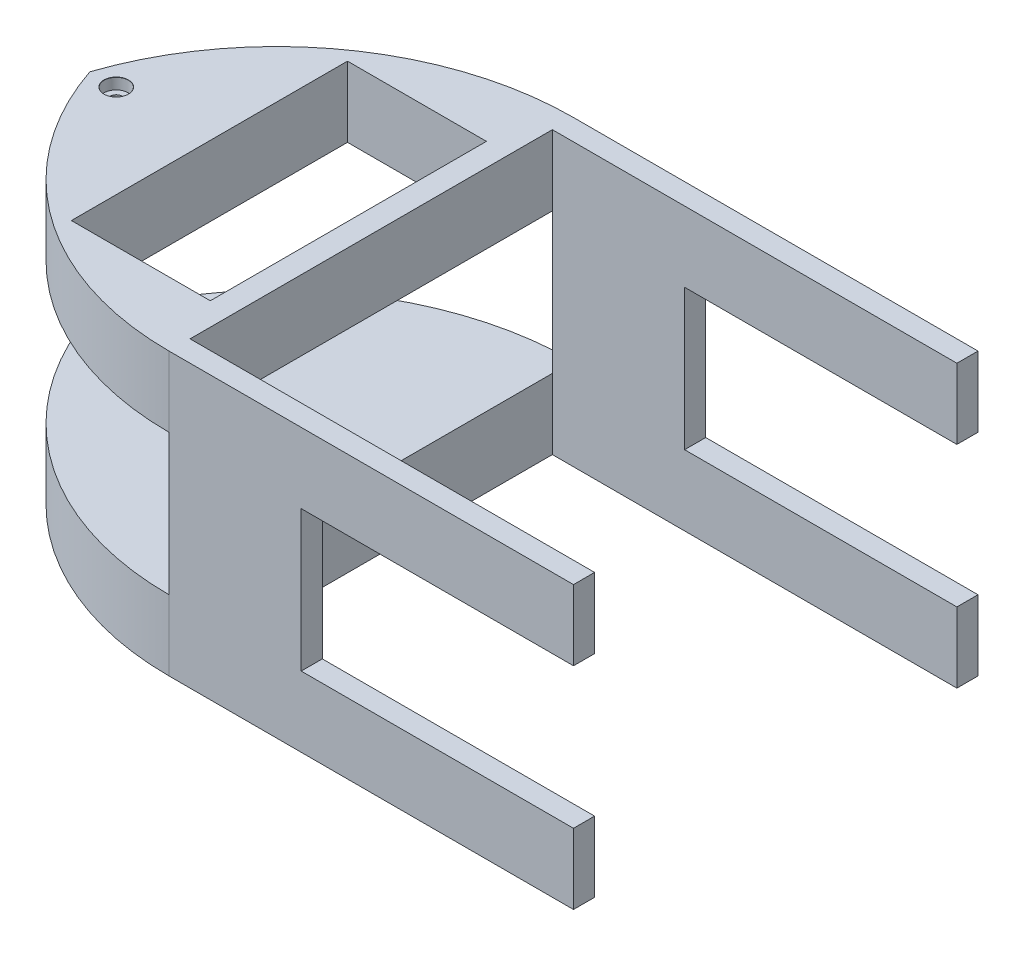
ISO-10303-21;
HEADER;
FILE_DESCRIPTION(('STEP AP214'),'2;1');
FILE_NAME('part.step','',(''),(''),'','','');
FILE_SCHEMA(('AUTOMOTIVE_DESIGN { 1 0 10303 214 1 1 1 1 }'));
ENDSEC;
DATA;
#1=APPLICATION_CONTEXT('core data for automotive mechanical design processes');
#2=APPLICATION_PROTOCOL_DEFINITION('international standard','automotive_design',2000,#1);
#3=PRODUCT_CONTEXT('',#1,'mechanical');
#4=PRODUCT('Part','Part','',(#3));
#5=PRODUCT_RELATED_PRODUCT_CATEGORY('part','',(#4));
#6=PRODUCT_DEFINITION_FORMATION('','',#4);
#7=PRODUCT_DEFINITION_CONTEXT('part definition',#1,'design');
#8=PRODUCT_DEFINITION('design','',#6,#7);
#9=PRODUCT_DEFINITION_SHAPE('','',#8);
#10=(LENGTH_UNIT() NAMED_UNIT(*) SI_UNIT(.MILLI.,.METRE.));
#11=(NAMED_UNIT(*) PLANE_ANGLE_UNIT() SI_UNIT($,.RADIAN.));
#12=(NAMED_UNIT(*) SI_UNIT($,.STERADIAN.) SOLID_ANGLE_UNIT());
#13=UNCERTAINTY_MEASURE_WITH_UNIT(LENGTH_MEASURE(1.E-05),#10,'distance_accuracy_value','');
#14=(GEOMETRIC_REPRESENTATION_CONTEXT(3) GLOBAL_UNCERTAINTY_ASSIGNED_CONTEXT((#13)) GLOBAL_UNIT_ASSIGNED_CONTEXT((#10,
#11,#12)) REPRESENTATION_CONTEXT('',''));
#15=CARTESIAN_POINT('',(0.,0.,0.));
#16=DIRECTION('',(0.,0.,1.));
#17=DIRECTION('',(1.,0.,0.));
#18=AXIS2_PLACEMENT_3D('',#15,#16,#17);
#19=CARTESIAN_POINT('',(0.,20.32,29.21));
#20=DIRECTION('',(0.,-1.,0.));
#21=DIRECTION('',(1.,0.,0.));
#22=AXIS2_PLACEMENT_3D('',#19,#20,#21);
#23=PLANE('',#22);
#24=DIRECTION('',(-1.,0.,0.));
#25=VECTOR('',#24,1.);
#26=CARTESIAN_POINT('',(-3.048,20.32,-19.939));
#27=LINE('',#26,#25);
#28=CARTESIAN_POINT('',(17.018,20.32,-19.939));
#29=VERTEX_POINT('',#28);
#30=CARTESIAN_POINT('',(-3.048,20.32,-19.939));
#31=VERTEX_POINT('',#30);
#32=EDGE_CURVE('E229',#29,#31,#27,.T.);
#33=ORIENTED_EDGE('',*,*,#32,.F.);
#34=DIRECTION('',(0.,0.,-1.));
#35=VECTOR('',#34,1.);
#36=CARTESIAN_POINT('',(17.018,20.32,19.939));
#37=LINE('',#36,#35);
#38=CARTESIAN_POINT('',(17.018,20.32,19.939));
#39=VERTEX_POINT('',#38);
#40=EDGE_CURVE('E49',#39,#29,#37,.T.);
#41=ORIENTED_EDGE('',*,*,#40,.F.);
#42=DIRECTION('',(1.,0.,0.));
#43=VECTOR('',#42,1.);
#44=CARTESIAN_POINT('',(-3.048,20.32,19.939));
#45=LINE('',#44,#43);
#46=CARTESIAN_POINT('',(-3.048,20.32,19.939));
#47=VERTEX_POINT('',#46);
#48=EDGE_CURVE('E217',#47,#39,#45,.T.);
#49=ORIENTED_EDGE('',*,*,#48,.F.);
#50=DIRECTION('',(0.,0.,1.));
#51=VECTOR('',#50,1.);
#52=CARTESIAN_POINT('',(-3.048,20.32,19.939));
#53=LINE('',#52,#51);
#54=EDGE_CURVE('E225',#31,#47,#53,.T.);
#55=ORIENTED_EDGE('',*,*,#54,.F.);
#56=EDGE_LOOP('',(#33,#41,#49,#55));
#57=FACE_BOUND('',#56,.T.);
#58=CARTESIAN_POINT('',(-16.51,20.32,0.));
#59=DIRECTION('',(0.,1.,0.));
#60=DIRECTION('',(0.,0.,1.));
#61=AXIS2_PLACEMENT_3D('',#58,#59,#60);
#62=CIRCLE('',#61,1.775);
#63=CARTESIAN_POINT('',(-16.51,20.32,1.775));
#64=VERTEX_POINT('',#63);
#65=EDGE_CURVE('E321',#64,#64,#62,.T.);
#66=ORIENTED_EDGE('',*,*,#65,.F.);
#67=EDGE_LOOP('',(#66));
#68=FACE_BOUND('',#67,.T.);
#69=CARTESIAN_POINT('',(20.32,20.32,-13.6663043478261));
#70=DIRECTION('',(0.,1.,0.));
#71=DIRECTION('',(-1.,0.,0.));
#72=AXIS2_PLACEMENT_3D('',#69,#70,#71);
#73=CIRCLE('',#72,42.8763043478261);
#74=CARTESIAN_POINT('',(-20.32,20.32,0.));
#75=VERTEX_POINT('',#74);
#76=CARTESIAN_POINT('',(20.32,20.32,29.21));
#77=VERTEX_POINT('',#76);
#78=EDGE_CURVE('E224',#75,#77,#73,.T.);
#79=ORIENTED_EDGE('',*,*,#78,.T.);
#80=DIRECTION('',(-1.,0.,0.));
#81=VECTOR('',#80,1.);
#82=CARTESIAN_POINT('',(0.,20.32,29.21));
#83=LINE('',#82,#81);
#84=CARTESIAN_POINT('',(78.74,20.32,29.21));
#85=VERTEX_POINT('',#84);
#86=EDGE_CURVE('E418',#85,#77,#83,.T.);
#87=ORIENTED_EDGE('',*,*,#86,.F.);
#88=DIRECTION('',(0.,0.,1.));
#89=VECTOR('',#88,1.);
#90=CARTESIAN_POINT('',(78.74,20.32,29.21));
#91=LINE('',#90,#89);
#92=CARTESIAN_POINT('',(78.74,20.32,26.162));
#93=VERTEX_POINT('',#92);
#94=EDGE_CURVE('E392',#93,#85,#91,.T.);
#95=ORIENTED_EDGE('',*,*,#94,.F.);
#96=DIRECTION('',(-1.,0.,0.));
#97=VECTOR('',#96,1.);
#98=CARTESIAN_POINT('',(78.74,20.32,26.162));
#99=LINE('',#98,#97);
#100=CARTESIAN_POINT('',(20.32,20.32,26.162));
#101=VERTEX_POINT('',#100);
#102=EDGE_CURVE('E395',#93,#101,#99,.T.);
#103=ORIENTED_EDGE('',*,*,#102,.T.);
#104=DIRECTION('',(0.,0.,-1.));
#105=VECTOR('',#104,1.);
#106=CARTESIAN_POINT('',(20.32,20.32,29.21));
#107=LINE('',#106,#105);
#108=CARTESIAN_POINT('',(20.32,20.32,-26.162));
#109=VERTEX_POINT('',#108);
#110=EDGE_CURVE('E410',#101,#109,#107,.T.);
#111=ORIENTED_EDGE('',*,*,#110,.T.);
#112=DIRECTION('',(-1.,0.,0.));
#113=VECTOR('',#112,1.);
#114=CARTESIAN_POINT('',(78.74,20.32,-26.162));
#115=LINE('',#114,#113);
#116=CARTESIAN_POINT('',(78.74,20.32,-26.162));
#117=VERTEX_POINT('',#116);
#118=EDGE_CURVE('E364',#117,#109,#115,.T.);
#119=ORIENTED_EDGE('',*,*,#118,.F.);
#120=DIRECTION('',(0.,0.,1.));
#121=VECTOR('',#120,1.);
#122=CARTESIAN_POINT('',(78.74,20.32,-29.21));
#123=LINE('',#122,#121);
#124=CARTESIAN_POINT('',(78.74,20.32,-29.21));
#125=VERTEX_POINT('',#124);
#126=EDGE_CURVE('E344',#125,#117,#123,.T.);
#127=ORIENTED_EDGE('',*,*,#126,.F.);
#128=DIRECTION('',(-1.,0.,0.));
#129=VECTOR('',#128,1.);
#130=CARTESIAN_POINT('',(0.,20.32,-29.21));
#131=LINE('',#130,#129);
#132=CARTESIAN_POINT('',(20.32,20.32,-29.21));
#133=VERTEX_POINT('',#132);
#134=EDGE_CURVE('E417',#125,#133,#131,.T.);
#135=ORIENTED_EDGE('',*,*,#134,.T.);
#136=CARTESIAN_POINT('',(20.32,20.32,13.6663043478261));
#137=DIRECTION('',(0.,1.,0.));
#138=DIRECTION('',(-1.,0.,0.));
#139=AXIS2_PLACEMENT_3D('',#136,#137,#138);
#140=CIRCLE('',#139,42.8763043478261);
#141=EDGE_CURVE('E255',#75,#133,#140,.F.);
#142=ORIENTED_EDGE('',*,*,#141,.F.);
#143=EDGE_LOOP('',(#79,#87,#95,#103,#111,#119,#127,#135,#142));
#144=FACE_BOUND('',#143,.T.);
#145=ADVANCED_FACE('F35',(#57,#68,#144),#23,.F.);
#146=CARTESIAN_POINT('',(0.,10.16,29.21));
#147=DIRECTION('',(0.,-1.,0.));
#148=DIRECTION('',(0.,0.,-1.));
#149=AXIS2_PLACEMENT_3D('',#146,#147,#148);
#150=PLANE('',#149);
#151=DIRECTION('',(0.,0.,-1.));
#152=VECTOR('',#151,1.);
#153=CARTESIAN_POINT('',(17.018,10.16,19.939));
#154=LINE('',#153,#152);
#155=CARTESIAN_POINT('',(17.018,10.16,19.939));
#156=VERTEX_POINT('',#155);
#157=CARTESIAN_POINT('',(17.018,10.16,-19.939));
#158=VERTEX_POINT('',#157);
#159=EDGE_CURVE('E210',#156,#158,#154,.T.);
#160=ORIENTED_EDGE('',*,*,#159,.T.);
#161=DIRECTION('',(-1.,0.,0.));
#162=VECTOR('',#161,1.);
#163=CARTESIAN_POINT('',(-3.04799999999999,10.16,-19.939));
#164=LINE('',#163,#162);
#165=CARTESIAN_POINT('',(-3.048,10.16,-19.939));
#166=VERTEX_POINT('',#165);
#167=EDGE_CURVE('E232',#158,#166,#164,.T.);
#168=ORIENTED_EDGE('',*,*,#167,.T.);
#169=DIRECTION('',(0.,0.,1.));
#170=VECTOR('',#169,1.);
#171=CARTESIAN_POINT('',(-3.048,10.16,19.939));
#172=LINE('',#171,#170);
#173=CARTESIAN_POINT('',(-3.048,10.16,19.939));
#174=VERTEX_POINT('',#173);
#175=EDGE_CURVE('E213',#166,#174,#172,.T.);
#176=ORIENTED_EDGE('',*,*,#175,.T.);
#177=DIRECTION('',(1.,0.,0.));
#178=VECTOR('',#177,1.);
#179=CARTESIAN_POINT('',(-3.04799999999999,10.16,19.939));
#180=LINE('',#179,#178);
#181=EDGE_CURVE('E214',#174,#156,#180,.T.);
#182=ORIENTED_EDGE('',*,*,#181,.T.);
#183=EDGE_LOOP('',(#160,#168,#176,#182));
#184=FACE_BOUND('',#183,.T.);
#185=CARTESIAN_POINT('',(-16.51,10.16,0.));
#186=DIRECTION('',(0.,-1.,0.));
#187=DIRECTION('',(0.,0.,-1.));
#188=AXIS2_PLACEMENT_3D('',#185,#186,#187);
#189=CIRCLE('',#188,0.899999999999997);
#190=CARTESIAN_POINT('',(-16.51,10.16,-0.899999999999997));
#191=VERTEX_POINT('',#190);
#192=EDGE_CURVE('E337',#191,#191,#189,.T.);
#193=ORIENTED_EDGE('',*,*,#192,.F.);
#194=EDGE_LOOP('',(#193));
#195=FACE_BOUND('',#194,.T.);
#196=DIRECTION('',(0.,0.,-1.));
#197=VECTOR('',#196,1.);
#198=CARTESIAN_POINT('',(20.32,10.16,29.21));
#199=LINE('',#198,#197);
#200=CARTESIAN_POINT('',(20.32,10.16,29.21));
#201=VERTEX_POINT('',#200);
#202=CARTESIAN_POINT('',(20.32,10.16,26.162));
#203=VERTEX_POINT('',#202);
#204=EDGE_CURVE('E414',#201,#203,#199,.T.);
#205=ORIENTED_EDGE('',*,*,#204,.F.);
#206=CARTESIAN_POINT('',(20.32,10.16,-13.6663043478261));
#207=DIRECTION('',(0.,-1.,0.));
#208=DIRECTION('',(0.,0.,-1.));
#209=AXIS2_PLACEMENT_3D('',#206,#207,#208);
#210=CIRCLE('',#209,42.8763043478261);
#211=CARTESIAN_POINT('',(-20.32,10.16,0.));
#212=VERTEX_POINT('',#211);
#213=EDGE_CURVE('E252',#201,#212,#210,.T.);
#214=ORIENTED_EDGE('',*,*,#213,.T.);
#215=CARTESIAN_POINT('',(20.32,10.16,13.6663043478261));
#216=DIRECTION('',(0.,-1.,0.));
#217=DIRECTION('',(0.,0.,-1.));
#218=AXIS2_PLACEMENT_3D('',#215,#216,#217);
#219=CIRCLE('',#218,42.8763043478261);
#220=CARTESIAN_POINT('',(20.32,10.16,-29.21));
#221=VERTEX_POINT('',#220);
#222=EDGE_CURVE('E271',#221,#212,#219,.F.);
#223=ORIENTED_EDGE('',*,*,#222,.F.);
#224=DIRECTION('',(0.,0.,-1.));
#225=VECTOR('',#224,1.);
#226=CARTESIAN_POINT('',(20.32,10.16,29.21));
#227=LINE('',#226,#225);
#228=CARTESIAN_POINT('',(20.32,10.16,-26.162));
#229=VERTEX_POINT('',#228);
#230=EDGE_CURVE('E370',#229,#221,#227,.T.);
#231=ORIENTED_EDGE('',*,*,#230,.F.);
#232=EDGE_CURVE('E413',#203,#229,#199,.T.);
#233=ORIENTED_EDGE('',*,*,#232,.F.);
#234=EDGE_LOOP('',(#205,#214,#223,#231,#233));
#235=FACE_BOUND('',#234,.T.);
#236=ADVANCED_FACE('F447',(#184,#195,#235),#150,.T.);
#237=CARTESIAN_POINT('',(78.74,-20.32,29.21));
#238=DIRECTION('',(0.,1.,0.));
#239=DIRECTION('',(0.,0.,1.));
#240=AXIS2_PLACEMENT_3D('',#237,#238,#239);
#241=PLANE('',#240);
#242=CARTESIAN_POINT('',(-16.51,-20.32,0.));
#243=DIRECTION('',(0.,1.,0.));
#244=DIRECTION('',(0.,0.,1.));
#245=AXIS2_PLACEMENT_3D('',#242,#243,#244);
#246=CIRCLE('',#245,0.899999999999989);
#247=CARTESIAN_POINT('',(-16.51,-20.32,0.899999999999989));
#248=VERTEX_POINT('',#247);
#249=EDGE_CURVE('E333',#248,#248,#246,.T.);
#250=ORIENTED_EDGE('',*,*,#249,.T.);
#251=EDGE_LOOP('',(#250));
#252=FACE_BOUND('',#251,.T.);
#253=CARTESIAN_POINT('',(20.32,-20.32,-13.6663043478261));
#254=DIRECTION('',(0.,1.,0.));
#255=DIRECTION('',(0.,0.,1.));
#256=AXIS2_PLACEMENT_3D('',#253,#254,#255);
#257=CIRCLE('',#256,42.8763043478261);
#258=CARTESIAN_POINT('',(-20.32,-20.32,0.));
#259=VERTEX_POINT('',#258);
#260=CARTESIAN_POINT('',(20.32,-20.32,29.21));
#261=VERTEX_POINT('',#260);
#262=EDGE_CURVE('E250',#259,#261,#257,.T.);
#263=ORIENTED_EDGE('',*,*,#262,.F.);
#264=CARTESIAN_POINT('',(20.32,-20.32,13.6663043478261));
#265=DIRECTION('',(0.,1.,0.));
#266=DIRECTION('',(0.,0.,1.));
#267=AXIS2_PLACEMENT_3D('',#264,#265,#266);
#268=CIRCLE('',#267,42.8763043478261);
#269=CARTESIAN_POINT('',(20.32,-20.32,-29.21));
#270=VERTEX_POINT('',#269);
#271=EDGE_CURVE('E268',#259,#270,#268,.F.);
#272=ORIENTED_EDGE('',*,*,#271,.T.);
#273=DIRECTION('',(-1.,0.,0.));
#274=VECTOR('',#273,1.);
#275=CARTESIAN_POINT('',(0.,-20.32,-29.21));
#276=LINE('',#275,#274);
#277=CARTESIAN_POINT('',(78.74,-20.32,-29.21));
#278=VERTEX_POINT('',#277);
#279=EDGE_CURVE('E373',#278,#270,#276,.T.);
#280=ORIENTED_EDGE('',*,*,#279,.F.);
#281=DIRECTION('',(0.,0.,-1.));
#282=VECTOR('',#281,1.);
#283=CARTESIAN_POINT('',(78.74,-20.32,-29.21));
#284=LINE('',#283,#282);
#285=CARTESIAN_POINT('',(78.74,-20.32,-26.162));
#286=VERTEX_POINT('',#285);
#287=EDGE_CURVE('E351',#286,#278,#284,.T.);
#288=ORIENTED_EDGE('',*,*,#287,.F.);
#289=DIRECTION('',(-1.,0.,0.));
#290=VECTOR('',#289,1.);
#291=CARTESIAN_POINT('',(78.74,-20.32,-26.162));
#292=LINE('',#291,#290);
#293=CARTESIAN_POINT('',(20.32,-20.32,-26.162));
#294=VERTEX_POINT('',#293);
#295=EDGE_CURVE('E354',#286,#294,#292,.T.);
#296=ORIENTED_EDGE('',*,*,#295,.T.);
#297=DIRECTION('',(0.,0.,-1.));
#298=VECTOR('',#297,1.);
#299=CARTESIAN_POINT('',(20.32,-20.32,29.21));
#300=LINE('',#299,#298);
#301=CARTESIAN_POINT('',(20.32,-20.32,26.162));
#302=VERTEX_POINT('',#301);
#303=EDGE_CURVE('E379',#302,#294,#300,.T.);
#304=ORIENTED_EDGE('',*,*,#303,.F.);
#305=DIRECTION('',(-1.,0.,0.));
#306=VECTOR('',#305,1.);
#307=CARTESIAN_POINT('',(78.74,-20.32,26.162));
#308=LINE('',#307,#306);
#309=CARTESIAN_POINT('',(78.74,-20.32,26.162));
#310=VERTEX_POINT('',#309);
#311=EDGE_CURVE('E404',#310,#302,#308,.T.);
#312=ORIENTED_EDGE('',*,*,#311,.F.);
#313=DIRECTION('',(0.,0.,-1.));
#314=VECTOR('',#313,1.);
#315=CARTESIAN_POINT('',(78.74,-20.32,29.21));
#316=LINE('',#315,#314);
#317=CARTESIAN_POINT('',(78.74,-20.32,29.21));
#318=VERTEX_POINT('',#317);
#319=EDGE_CURVE('E385',#318,#310,#316,.T.);
#320=ORIENTED_EDGE('',*,*,#319,.F.);
#321=DIRECTION('',(-1.,0.,0.));
#322=VECTOR('',#321,1.);
#323=CARTESIAN_POINT('',(78.74,-20.32,29.21));
#324=LINE('',#323,#322);
#325=EDGE_CURVE('E407',#318,#261,#324,.T.);
#326=ORIENTED_EDGE('',*,*,#325,.T.);
#327=EDGE_LOOP('',(#263,#272,#280,#288,#296,#304,#312,#320,#326));
#328=FACE_BOUND('',#327,.T.);
#329=ADVANCED_FACE('F451',(#252,#328),#241,.F.);
#330=CARTESIAN_POINT('',(0.,-10.16,29.21));
#331=DIRECTION('',(0.,-1.,0.));
#332=DIRECTION('',(0.,0.,-1.));
#333=AXIS2_PLACEMENT_3D('',#330,#331,#332);
#334=PLANE('',#333);
#335=CARTESIAN_POINT('',(-16.51,-10.16,0.));
#336=DIRECTION('',(0.,-1.,0.));
#337=DIRECTION('',(0.,0.,-1.));
#338=AXIS2_PLACEMENT_3D('',#335,#336,#337);
#339=CIRCLE('',#338,0.899999999999997);
#340=CARTESIAN_POINT('',(-16.51,-10.16,-0.899999999999997));
#341=VERTEX_POINT('',#340);
#342=EDGE_CURVE('E336',#341,#341,#339,.T.);
#343=ORIENTED_EDGE('',*,*,#342,.T.);
#344=EDGE_LOOP('',(#343));
#345=FACE_BOUND('',#344,.T.);
#346=CARTESIAN_POINT('',(20.32,-10.16,-13.6663043478261));
#347=DIRECTION('',(0.,-1.,0.));
#348=DIRECTION('',(0.,0.,-1.));
#349=AXIS2_PLACEMENT_3D('',#346,#347,#348);
#350=CIRCLE('',#349,42.8763043478261);
#351=CARTESIAN_POINT('',(20.32,-10.16,29.21));
#352=VERTEX_POINT('',#351);
#353=CARTESIAN_POINT('',(-20.32,-10.16,0.));
#354=VERTEX_POINT('',#353);
#355=EDGE_CURVE('E248',#352,#354,#350,.T.);
#356=ORIENTED_EDGE('',*,*,#355,.F.);
#357=DIRECTION('',(0.,0.,-1.));
#358=VECTOR('',#357,1.);
#359=CARTESIAN_POINT('',(20.32,-10.16,29.21));
#360=LINE('',#359,#358);
#361=CARTESIAN_POINT('',(20.32,-10.16,26.162));
#362=VERTEX_POINT('',#361);
#363=EDGE_CURVE('E377',#352,#362,#360,.T.);
#364=ORIENTED_EDGE('',*,*,#363,.T.);
#365=CARTESIAN_POINT('',(20.32,-10.16,-26.162));
#366=VERTEX_POINT('',#365);
#367=EDGE_CURVE('E376',#362,#366,#360,.T.);
#368=ORIENTED_EDGE('',*,*,#367,.T.);
#369=DIRECTION('',(0.,0.,-1.));
#370=VECTOR('',#369,1.);
#371=CARTESIAN_POINT('',(20.32,-10.16,29.21));
#372=LINE('',#371,#370);
#373=CARTESIAN_POINT('',(20.32,-10.16,-29.21));
#374=VERTEX_POINT('',#373);
#375=EDGE_CURVE('E367',#366,#374,#372,.T.);
#376=ORIENTED_EDGE('',*,*,#375,.T.);
#377=CARTESIAN_POINT('',(20.32,-10.16,13.6663043478261));
#378=DIRECTION('',(0.,-1.,0.));
#379=DIRECTION('',(0.,0.,-1.));
#380=AXIS2_PLACEMENT_3D('',#377,#378,#379);
#381=CIRCLE('',#380,42.8763043478261);
#382=EDGE_CURVE('E265',#374,#354,#381,.F.);
#383=ORIENTED_EDGE('',*,*,#382,.T.);
#384=EDGE_LOOP('',(#356,#364,#368,#376,#383));
#385=FACE_BOUND('',#384,.T.);
#386=ADVANCED_FACE('F425',(#345,#385),#334,.F.);
#387=CARTESIAN_POINT('',(0.,0.,29.21));
#388=DIRECTION('',(0.,0.,-1.));
#389=DIRECTION('',(-1.,0.,0.));
#390=AXIS2_PLACEMENT_3D('',#387,#388,#389);
#391=PLANE('',#390);
#392=DIRECTION('',(0.,1.,0.));
#393=VECTOR('',#392,1.);
#394=CARTESIAN_POINT('',(20.32,-38.1,29.21));
#395=LINE('',#394,#393);
#396=EDGE_CURVE('E247',#261,#352,#395,.T.);
#397=ORIENTED_EDGE('',*,*,#396,.F.);
#398=ORIENTED_EDGE('',*,*,#325,.F.);
#399=DIRECTION('',(0.,-1.,0.));
#400=VECTOR('',#399,1.);
#401=CARTESIAN_POINT('',(78.74,20.32,29.21));
#402=LINE('',#401,#400);
#403=CARTESIAN_POINT('',(78.74,-10.16,29.21));
#404=VERTEX_POINT('',#403);
#405=EDGE_CURVE('E386',#404,#318,#402,.T.);
#406=ORIENTED_EDGE('',*,*,#405,.F.);
#407=DIRECTION('',(1.,0.,0.));
#408=VECTOR('',#407,1.);
#409=CARTESIAN_POINT('',(78.74,-10.16,29.21));
#410=LINE('',#409,#408);
#411=CARTESIAN_POINT('',(39.4163773659304,-10.16,29.21));
#412=VERTEX_POINT('',#411);
#413=EDGE_CURVE('E279',#412,#404,#410,.T.);
#414=ORIENTED_EDGE('',*,*,#413,.F.);
#415=DIRECTION('',(0.,-1.,0.));
#416=VECTOR('',#415,1.);
#417=CARTESIAN_POINT('',(39.4163773659304,10.16,29.21));
#418=LINE('',#417,#416);
#419=CARTESIAN_POINT('',(39.4163773659304,10.16,29.21));
#420=VERTEX_POINT('',#419);
#421=EDGE_CURVE('E288',#420,#412,#418,.T.);
#422=ORIENTED_EDGE('',*,*,#421,.F.);
#423=DIRECTION('',(-1.,0.,0.));
#424=VECTOR('',#423,1.);
#425=CARTESIAN_POINT('',(78.74,10.16,29.21));
#426=LINE('',#425,#424);
#427=CARTESIAN_POINT('',(78.74,10.16,29.21));
#428=VERTEX_POINT('',#427);
#429=EDGE_CURVE('E274',#428,#420,#426,.T.);
#430=ORIENTED_EDGE('',*,*,#429,.F.);
#431=EDGE_CURVE('E382',#85,#428,#402,.T.);
#432=ORIENTED_EDGE('',*,*,#431,.F.);
#433=ORIENTED_EDGE('',*,*,#86,.T.);
#434=EDGE_CURVE('E245',#201,#77,#395,.T.);
#435=ORIENTED_EDGE('',*,*,#434,.F.);
#436=DIRECTION('',(0.,-1.,0.));
#437=VECTOR('',#436,1.);
#438=CARTESIAN_POINT('',(20.32,20.32,29.21));
#439=LINE('',#438,#437);
#440=EDGE_CURVE('E381',#201,#352,#439,.T.);
#441=ORIENTED_EDGE('',*,*,#440,.T.);
#442=EDGE_LOOP('',(#397,#398,#406,#414,#422,#430,#432,#433,#435,#441));
#443=FACE_BOUND('',#442,.T.);
#444=ADVANCED_FACE('F466',(#443),#391,.F.);
#445=CARTESIAN_POINT('',(78.74,0.,0.));
#446=DIRECTION('',(1.,0.,0.));
#447=DIRECTION('',(0.,0.,-1.));
#448=AXIS2_PLACEMENT_3D('',#445,#446,#447);
#449=PLANE('',#448);
#450=DIRECTION('',(0.,0.,1.));
#451=VECTOR('',#450,1.);
#452=CARTESIAN_POINT('',(78.74,-10.16,-29.21));
#453=LINE('',#452,#451);
#454=CARTESIAN_POINT('',(78.74,-10.16,26.162));
#455=VERTEX_POINT('',#454);
#456=EDGE_CURVE('E296',#455,#404,#453,.T.);
#457=ORIENTED_EDGE('',*,*,#456,.T.);
#458=ORIENTED_EDGE('',*,*,#405,.T.);
#459=ORIENTED_EDGE('',*,*,#319,.T.);
#460=DIRECTION('',(0.,1.,0.));
#461=VECTOR('',#460,1.);
#462=CARTESIAN_POINT('',(78.74,20.32,26.162));
#463=LINE('',#462,#461);
#464=EDGE_CURVE('E389',#310,#455,#463,.T.);
#465=ORIENTED_EDGE('',*,*,#464,.T.);
#466=EDGE_LOOP('',(#457,#458,#459,#465));
#467=FACE_BOUND('',#466,.T.);
#468=ADVANCED_FACE('F469',(#467),#449,.T.);
#469=CARTESIAN_POINT('',(78.74,0.,0.));
#470=DIRECTION('',(-1.,0.,0.));
#471=DIRECTION('',(0.,0.,1.));
#472=AXIS2_PLACEMENT_3D('',#469,#470,#471);
#473=PLANE('',#472);
#474=DIRECTION('',(0.,1.,0.));
#475=VECTOR('',#474,1.);
#476=CARTESIAN_POINT('',(78.74,20.32,-29.21));
#477=LINE('',#476,#475);
#478=CARTESIAN_POINT('',(78.74,-10.16,-29.21));
#479=VERTEX_POINT('',#478);
#480=EDGE_CURVE('E341',#278,#479,#477,.T.);
#481=ORIENTED_EDGE('',*,*,#480,.T.);
#482=CARTESIAN_POINT('',(78.74,-10.16,-26.162));
#483=VERTEX_POINT('',#482);
#484=EDGE_CURVE('E292',#479,#483,#453,.T.);
#485=ORIENTED_EDGE('',*,*,#484,.T.);
#486=DIRECTION('',(0.,-1.,0.));
#487=VECTOR('',#486,1.);
#488=CARTESIAN_POINT('',(78.74,20.32,-26.162));
#489=LINE('',#488,#487);
#490=EDGE_CURVE('E347',#483,#286,#489,.T.);
#491=ORIENTED_EDGE('',*,*,#490,.T.);
#492=ORIENTED_EDGE('',*,*,#287,.T.);
#493=EDGE_LOOP('',(#481,#485,#491,#492));
#494=FACE_BOUND('',#493,.T.);
#495=ADVANCED_FACE('F443',(#494),#473,.F.);
#496=CARTESIAN_POINT('',(20.32,10.16,29.21));
#497=DIRECTION('',(-1.,0.,0.));
#498=DIRECTION('',(0.,0.,1.));
#499=AXIS2_PLACEMENT_3D('',#496,#497,#498);
#500=PLANE('',#499);
#501=DIRECTION('',(0.,-1.,0.));
#502=VECTOR('',#501,1.);
#503=CARTESIAN_POINT('',(20.32,20.32,-26.162));
#504=LINE('',#503,#502);
#505=EDGE_CURVE('E358',#109,#229,#504,.T.);
#506=ORIENTED_EDGE('',*,*,#505,.F.);
#507=ORIENTED_EDGE('',*,*,#110,.F.);
#508=DIRECTION('',(0.,1.,0.));
#509=VECTOR('',#508,1.);
#510=CARTESIAN_POINT('',(20.32,20.32,26.162));
#511=LINE('',#510,#509);
#512=EDGE_CURVE('E42',#203,#101,#511,.T.);
#513=ORIENTED_EDGE('',*,*,#512,.F.);
#514=ORIENTED_EDGE('',*,*,#232,.T.);
#515=EDGE_LOOP('',(#506,#507,#513,#514));
#516=FACE_BOUND('',#515,.T.);
#517=ADVANCED_FACE('F471',(#516),#500,.F.);
#518=CARTESIAN_POINT('',(20.32,0.,29.21));
#519=DIRECTION('',(-1.,0.,0.));
#520=DIRECTION('',(0.,0.,1.));
#521=AXIS2_PLACEMENT_3D('',#518,#519,#520);
#522=PLANE('',#521);
#523=EDGE_CURVE('E357',#366,#294,#504,.T.);
#524=ORIENTED_EDGE('',*,*,#523,.F.);
#525=ORIENTED_EDGE('',*,*,#367,.F.);
#526=EDGE_CURVE('E399',#302,#362,#511,.T.);
#527=ORIENTED_EDGE('',*,*,#526,.F.);
#528=ORIENTED_EDGE('',*,*,#303,.T.);
#529=EDGE_LOOP('',(#524,#525,#527,#528));
#530=FACE_BOUND('',#529,.T.);
#531=ADVANCED_FACE('F473',(#530),#522,.F.);
#532=CARTESIAN_POINT('',(20.32,0.,0.));
#533=DIRECTION('',(1.,0.,0.));
#534=DIRECTION('',(0.,0.,-1.));
#535=AXIS2_PLACEMENT_3D('',#532,#533,#534);
#536=PLANE('',#535);
#537=ORIENTED_EDGE('',*,*,#363,.F.);
#538=ORIENTED_EDGE('',*,*,#440,.F.);
#539=ORIENTED_EDGE('',*,*,#204,.T.);
#540=EDGE_CURVE('E398',#362,#203,#511,.T.);
#541=ORIENTED_EDGE('',*,*,#540,.F.);
#542=EDGE_LOOP('',(#537,#538,#539,#541));
#543=FACE_BOUND('',#542,.T.);
#544=ADVANCED_FACE('F464',(#543),#536,.F.);
#545=CARTESIAN_POINT('',(0.,0.,-29.21));
#546=DIRECTION('',(0.,0.,-1.));
#547=DIRECTION('',(-1.,0.,0.));
#548=AXIS2_PLACEMENT_3D('',#545,#546,#547);
#549=PLANE('',#548);
#550=DIRECTION('',(0.,1.,0.));
#551=VECTOR('',#550,1.);
#552=CARTESIAN_POINT('',(20.32,-38.1,-29.21));
#553=LINE('',#552,#551);
#554=EDGE_CURVE('E258',#221,#133,#553,.T.);
#555=ORIENTED_EDGE('',*,*,#554,.T.);
#556=ORIENTED_EDGE('',*,*,#134,.F.);
#557=CARTESIAN_POINT('',(78.74,10.16,-29.21));
#558=VERTEX_POINT('',#557);
#559=EDGE_CURVE('E345',#558,#125,#477,.T.);
#560=ORIENTED_EDGE('',*,*,#559,.F.);
#561=DIRECTION('',(-1.,0.,0.));
#562=VECTOR('',#561,1.);
#563=CARTESIAN_POINT('',(78.74,10.16,-29.21));
#564=LINE('',#563,#562);
#565=CARTESIAN_POINT('',(39.4163773659304,10.16,-29.21));
#566=VERTEX_POINT('',#565);
#567=EDGE_CURVE('E275',#558,#566,#564,.T.);
#568=ORIENTED_EDGE('',*,*,#567,.T.);
#569=DIRECTION('',(0.,-1.,0.));
#570=VECTOR('',#569,1.);
#571=CARTESIAN_POINT('',(39.4163773659304,10.16,-29.21));
#572=LINE('',#571,#570);
#573=CARTESIAN_POINT('',(39.4163773659304,-10.16,-29.21));
#574=VERTEX_POINT('',#573);
#575=EDGE_CURVE('E278',#566,#574,#572,.T.);
#576=ORIENTED_EDGE('',*,*,#575,.T.);
#577=DIRECTION('',(1.,0.,0.));
#578=VECTOR('',#577,1.);
#579=CARTESIAN_POINT('',(78.74,-10.16,-29.21));
#580=LINE('',#579,#578);
#581=EDGE_CURVE('E282',#574,#479,#580,.T.);
#582=ORIENTED_EDGE('',*,*,#581,.T.);
#583=ORIENTED_EDGE('',*,*,#480,.F.);
#584=ORIENTED_EDGE('',*,*,#279,.T.);
#585=EDGE_CURVE('E261',#270,#374,#553,.T.);
#586=ORIENTED_EDGE('',*,*,#585,.T.);
#587=DIRECTION('',(0.,1.,0.));
#588=VECTOR('',#587,1.);
#589=CARTESIAN_POINT('',(20.32,20.32,-29.21));
#590=LINE('',#589,#588);
#591=EDGE_CURVE('E340',#374,#221,#590,.T.);
#592=ORIENTED_EDGE('',*,*,#591,.T.);
#593=EDGE_LOOP('',(#555,#556,#560,#568,#576,#582,#583,#584,#586,#592));
#594=FACE_BOUND('',#593,.T.);
#595=ADVANCED_FACE('F460',(#594),#549,.T.);
#596=CARTESIAN_POINT('',(78.74,20.32,26.162));
#597=DIRECTION('',(0.,0.,1.));
#598=DIRECTION('',(0.,-1.,0.));
#599=AXIS2_PLACEMENT_3D('',#596,#597,#598);
#600=PLANE('',#599);
#601=DIRECTION('',(0.,-1.,0.));
#602=VECTOR('',#601,1.);
#603=CARTESIAN_POINT('',(39.4163773659304,20.32,26.162));
#604=LINE('',#603,#602);
#605=CARTESIAN_POINT('',(39.4163773659304,10.16,26.162));
#606=VERTEX_POINT('',#605);
#607=CARTESIAN_POINT('',(39.4163773659304,-10.16,26.162));
#608=VERTEX_POINT('',#607);
#609=EDGE_CURVE('E318',#606,#608,#604,.T.);
#610=ORIENTED_EDGE('',*,*,#609,.T.);
#611=DIRECTION('',(1.,0.,0.));
#612=VECTOR('',#611,1.);
#613=CARTESIAN_POINT('',(78.74,-10.16,26.162));
#614=LINE('',#613,#612);
#615=EDGE_CURVE('E315',#608,#455,#614,.T.);
#616=ORIENTED_EDGE('',*,*,#615,.T.);
#617=ORIENTED_EDGE('',*,*,#464,.F.);
#618=ORIENTED_EDGE('',*,*,#311,.T.);
#619=ORIENTED_EDGE('',*,*,#526,.T.);
#620=ORIENTED_EDGE('',*,*,#540,.T.);
#621=ORIENTED_EDGE('',*,*,#512,.T.);
#622=ORIENTED_EDGE('',*,*,#102,.F.);
#623=CARTESIAN_POINT('',(78.74,10.16,26.162));
#624=VERTEX_POINT('',#623);
#625=EDGE_CURVE('E388',#624,#93,#463,.T.);
#626=ORIENTED_EDGE('',*,*,#625,.F.);
#627=DIRECTION('',(-1.,0.,0.));
#628=VECTOR('',#627,1.);
#629=CARTESIAN_POINT('',(78.74,10.16,26.162));
#630=LINE('',#629,#628);
#631=EDGE_CURVE('E309',#624,#606,#630,.T.);
#632=ORIENTED_EDGE('',*,*,#631,.T.);
#633=EDGE_LOOP('',(#610,#616,#617,#618,#619,#620,#621,#622,#626,#632));
#634=FACE_BOUND('',#633,.T.);
#635=ADVANCED_FACE('F463',(#634),#600,.F.);
#636=DIRECTION('',(0.,0.,1.));
#637=VECTOR('',#636,1.);
#638=CARTESIAN_POINT('',(78.74,10.16,-29.21));
#639=LINE('',#638,#637);
#640=EDGE_CURVE('E285',#624,#428,#639,.T.);
#641=ORIENTED_EDGE('',*,*,#640,.F.);
#642=ORIENTED_EDGE('',*,*,#625,.T.);
#643=ORIENTED_EDGE('',*,*,#94,.T.);
#644=ORIENTED_EDGE('',*,*,#431,.T.);
#645=EDGE_LOOP('',(#641,#642,#643,#644));
#646=FACE_BOUND('',#645,.T.);
#647=ADVANCED_FACE('F478',(#646),#449,.T.);
#648=CARTESIAN_POINT('',(20.32,0.,0.));
#649=DIRECTION('',(-1.,0.,0.));
#650=DIRECTION('',(0.,0.,1.));
#651=AXIS2_PLACEMENT_3D('',#648,#649,#650);
#652=PLANE('',#651);
#653=EDGE_CURVE('E361',#229,#366,#504,.T.);
#654=ORIENTED_EDGE('',*,*,#653,.F.);
#655=ORIENTED_EDGE('',*,*,#230,.T.);
#656=ORIENTED_EDGE('',*,*,#591,.F.);
#657=ORIENTED_EDGE('',*,*,#375,.F.);
#658=EDGE_LOOP('',(#654,#655,#656,#657));
#659=FACE_BOUND('',#658,.T.);
#660=ADVANCED_FACE('F485',(#659),#652,.T.);
#661=CARTESIAN_POINT('',(78.74,20.32,-26.162));
#662=DIRECTION('',(0.,0.,-1.));
#663=DIRECTION('',(0.,1.,0.));
#664=AXIS2_PLACEMENT_3D('',#661,#662,#663);
#665=PLANE('',#664);
#666=ORIENTED_EDGE('',*,*,#490,.F.);
#667=DIRECTION('',(-1.,0.,0.));
#668=VECTOR('',#667,1.);
#669=CARTESIAN_POINT('',(78.74,-10.16,-26.162));
#670=LINE('',#669,#668);
#671=CARTESIAN_POINT('',(39.4163773659304,-10.16,-26.162));
#672=VERTEX_POINT('',#671);
#673=EDGE_CURVE('E312',#483,#672,#670,.T.);
#674=ORIENTED_EDGE('',*,*,#673,.T.);
#675=DIRECTION('',(0.,1.,0.));
#676=VECTOR('',#675,1.);
#677=CARTESIAN_POINT('',(39.4163773659304,20.32,-26.162));
#678=LINE('',#677,#676);
#679=CARTESIAN_POINT('',(39.4163773659304,10.16,-26.162));
#680=VERTEX_POINT('',#679);
#681=EDGE_CURVE('E11',#672,#680,#678,.T.);
#682=ORIENTED_EDGE('',*,*,#681,.T.);
#683=DIRECTION('',(1.,0.,0.));
#684=VECTOR('',#683,1.);
#685=CARTESIAN_POINT('',(78.74,10.16,-26.162));
#686=LINE('',#685,#684);
#687=CARTESIAN_POINT('',(78.74,10.16,-26.162));
#688=VERTEX_POINT('',#687);
#689=EDGE_CURVE('E295',#680,#688,#686,.T.);
#690=ORIENTED_EDGE('',*,*,#689,.T.);
#691=EDGE_CURVE('E348',#117,#688,#489,.T.);
#692=ORIENTED_EDGE('',*,*,#691,.F.);
#693=ORIENTED_EDGE('',*,*,#118,.T.);
#694=ORIENTED_EDGE('',*,*,#505,.T.);
#695=ORIENTED_EDGE('',*,*,#653,.T.);
#696=ORIENTED_EDGE('',*,*,#523,.T.);
#697=ORIENTED_EDGE('',*,*,#295,.F.);
#698=EDGE_LOOP('',(#666,#674,#682,#690,#692,#693,#694,#695,#696,#697));
#699=FACE_BOUND('',#698,.T.);
#700=ADVANCED_FACE('F440',(#699),#665,.F.);
#701=ORIENTED_EDGE('',*,*,#691,.T.);
#702=EDGE_CURVE('E305',#558,#688,#639,.T.);
#703=ORIENTED_EDGE('',*,*,#702,.F.);
#704=ORIENTED_EDGE('',*,*,#559,.T.);
#705=ORIENTED_EDGE('',*,*,#126,.T.);
#706=EDGE_LOOP('',(#701,#703,#704,#705));
#707=FACE_BOUND('',#706,.T.);
#708=ADVANCED_FACE('F431',(#707),#473,.F.);
#709=CARTESIAN_POINT('',(-16.51,20.32,0.));
#710=DIRECTION('',(0.,1.,0.));
#711=DIRECTION('',(0.,0.,1.));
#712=AXIS2_PLACEMENT_3D('',#709,#710,#711);
#713=CYLINDRICAL_SURFACE('',#712,0.899999999999997);
#714=ORIENTED_EDGE('',*,*,#249,.F.);
#715=EDGE_LOOP('',(#714));
#716=FACE_BOUND('',#715,.T.);
#717=ORIENTED_EDGE('',*,*,#342,.F.);
#718=EDGE_LOOP('',(#717));
#719=FACE_BOUND('',#718,.T.);
#720=ADVANCED_FACE('F428',(#716,#719),#713,.F.);
#721=ORIENTED_EDGE('',*,*,#192,.T.);
#722=EDGE_LOOP('',(#721));
#723=FACE_BOUND('',#722,.T.);
#724=CARTESIAN_POINT('',(-16.51,18.72,0.));
#725=DIRECTION('',(0.,1.,0.));
#726=DIRECTION('',(0.,0.,1.));
#727=AXIS2_PLACEMENT_3D('',#724,#725,#726);
#728=CIRCLE('',#727,0.900000000000005);
#729=CARTESIAN_POINT('',(-16.51,18.72,0.900000000000005));
#730=VERTEX_POINT('',#729);
#731=EDGE_CURVE('E330',#730,#730,#728,.T.);
#732=ORIENTED_EDGE('',*,*,#731,.T.);
#733=EDGE_LOOP('',(#732));
#734=FACE_BOUND('',#733,.T.);
#735=ADVANCED_FACE('F430',(#723,#734),#713,.F.);
#736=CARTESIAN_POINT('',(-14.76,18.72,0.));
#737=DIRECTION('',(0.,-1.,0.));
#738=DIRECTION('',(0.,0.,-1.));
#739=AXIS2_PLACEMENT_3D('',#736,#737,#738);
#740=PLANE('',#739);
#741=ORIENTED_EDGE('',*,*,#731,.F.);
#742=EDGE_LOOP('',(#741));
#743=FACE_BOUND('',#742,.T.);
#744=CARTESIAN_POINT('',(-16.51,18.72,0.));
#745=DIRECTION('',(0.,1.,0.));
#746=DIRECTION('',(0.,0.,1.));
#747=AXIS2_PLACEMENT_3D('',#744,#745,#746);
#748=CIRCLE('',#747,1.75);
#749=CARTESIAN_POINT('',(-16.51,18.72,1.75));
#750=VERTEX_POINT('',#749);
#751=EDGE_CURVE('E327',#750,#750,#748,.T.);
#752=ORIENTED_EDGE('',*,*,#751,.T.);
#753=EDGE_LOOP('',(#752));
#754=FACE_BOUND('',#753,.T.);
#755=ADVANCED_FACE('F438',(#743,#754),#740,.F.);
#756=CARTESIAN_POINT('',(-16.51,20.32,0.));
#757=DIRECTION('',(0.,1.,0.));
#758=DIRECTION('',(0.,0.,1.));
#759=AXIS2_PLACEMENT_3D('',#756,#757,#758);
#760=CYLINDRICAL_SURFACE('',#759,1.75);
#761=ORIENTED_EDGE('',*,*,#751,.F.);
#762=EDGE_LOOP('',(#761));
#763=FACE_BOUND('',#762,.T.);
#764=CARTESIAN_POINT('',(-16.51,20.295,0.));
#765=DIRECTION('',(0.,1.,0.));
#766=DIRECTION('',(0.,0.,1.));
#767=AXIS2_PLACEMENT_3D('',#764,#765,#766);
#768=CIRCLE('',#767,1.75);
#769=CARTESIAN_POINT('',(-16.51,20.295,1.75));
#770=VERTEX_POINT('',#769);
#771=EDGE_CURVE('E324',#770,#770,#768,.T.);
#772=ORIENTED_EDGE('',*,*,#771,.T.);
#773=EDGE_LOOP('',(#772));
#774=FACE_BOUND('',#773,.T.);
#775=ADVANCED_FACE('F566',(#763,#774),#760,.F.);
#776=CARTESIAN_POINT('',(-16.51,20.32,0.));
#777=DIRECTION('',(0.,1.,0.));
#778=DIRECTION('',(0.,0.,1.));
#779=AXIS2_PLACEMENT_3D('',#776,#777,#778);
#780=CONICAL_SURFACE('',#779,1.775,0.785398163397448);
#781=ORIENTED_EDGE('',*,*,#771,.F.);
#782=EDGE_LOOP('',(#781));
#783=FACE_BOUND('',#782,.T.);
#784=ORIENTED_EDGE('',*,*,#65,.T.);
#785=EDGE_LOOP('',(#784));
#786=FACE_BOUND('',#785,.T.);
#787=ADVANCED_FACE('F557',(#783,#786),#780,.F.);
#788=CARTESIAN_POINT('',(78.74,10.16,-29.21));
#789=DIRECTION('',(0.,1.,0.));
#790=DIRECTION('',(-1.,0.,0.));
#791=AXIS2_PLACEMENT_3D('',#788,#789,#790);
#792=PLANE('',#791);
#793=DIRECTION('',(0.,0.,1.));
#794=VECTOR('',#793,1.);
#795=CARTESIAN_POINT('',(39.4163773659304,10.16,-29.21));
#796=LINE('',#795,#794);
#797=EDGE_CURVE('E301',#566,#680,#796,.T.);
#798=ORIENTED_EDGE('',*,*,#797,.F.);
#799=ORIENTED_EDGE('',*,*,#567,.F.);
#800=ORIENTED_EDGE('',*,*,#702,.T.);
#801=ORIENTED_EDGE('',*,*,#689,.F.);
#802=EDGE_LOOP('',(#798,#799,#800,#801));
#803=FACE_BOUND('',#802,.T.);
#804=ADVANCED_FACE('F554',(#803),#792,.F.);
#805=CARTESIAN_POINT('',(78.74,-10.16,-29.21));
#806=DIRECTION('',(0.,-1.,0.));
#807=DIRECTION('',(1.,0.,0.));
#808=AXIS2_PLACEMENT_3D('',#805,#806,#807);
#809=PLANE('',#808);
#810=ORIENTED_EDGE('',*,*,#484,.F.);
#811=ORIENTED_EDGE('',*,*,#581,.F.);
#812=DIRECTION('',(0.,0.,1.));
#813=VECTOR('',#812,1.);
#814=CARTESIAN_POINT('',(39.4163773659304,-10.16,-29.21));
#815=LINE('',#814,#813);
#816=EDGE_CURVE('E297',#574,#672,#815,.T.);
#817=ORIENTED_EDGE('',*,*,#816,.T.);
#818=ORIENTED_EDGE('',*,*,#673,.F.);
#819=EDGE_LOOP('',(#810,#811,#817,#818));
#820=FACE_BOUND('',#819,.T.);
#821=ADVANCED_FACE('F550',(#820),#809,.F.);
#822=CARTESIAN_POINT('',(39.4163773659304,10.16,-29.21));
#823=DIRECTION('',(-1.,0.,0.));
#824=DIRECTION('',(0.,0.,1.));
#825=AXIS2_PLACEMENT_3D('',#822,#823,#824);
#826=PLANE('',#825);
#827=ORIENTED_EDGE('',*,*,#816,.F.);
#828=ORIENTED_EDGE('',*,*,#575,.F.);
#829=ORIENTED_EDGE('',*,*,#797,.T.);
#830=ORIENTED_EDGE('',*,*,#681,.F.);
#831=EDGE_LOOP('',(#827,#828,#829,#830));
#832=FACE_BOUND('',#831,.T.);
#833=ADVANCED_FACE('F552',(#832),#826,.F.);
#834=EDGE_CURVE('E304',#606,#420,#796,.T.);
#835=ORIENTED_EDGE('',*,*,#834,.T.);
#836=ORIENTED_EDGE('',*,*,#421,.T.);
#837=EDGE_CURVE('E300',#608,#412,#815,.T.);
#838=ORIENTED_EDGE('',*,*,#837,.F.);
#839=ORIENTED_EDGE('',*,*,#609,.F.);
#840=EDGE_LOOP('',(#835,#836,#838,#839));
#841=FACE_BOUND('',#840,.T.);
#842=ADVANCED_FACE('F578',(#841),#826,.F.);
#843=ORIENTED_EDGE('',*,*,#837,.T.);
#844=ORIENTED_EDGE('',*,*,#413,.T.);
#845=ORIENTED_EDGE('',*,*,#456,.F.);
#846=ORIENTED_EDGE('',*,*,#615,.F.);
#847=EDGE_LOOP('',(#843,#844,#845,#846));
#848=FACE_BOUND('',#847,.T.);
#849=ADVANCED_FACE('F565',(#848),#809,.F.);
#850=ORIENTED_EDGE('',*,*,#640,.T.);
#851=ORIENTED_EDGE('',*,*,#429,.T.);
#852=ORIENTED_EDGE('',*,*,#834,.F.);
#853=ORIENTED_EDGE('',*,*,#631,.F.);
#854=EDGE_LOOP('',(#850,#851,#852,#853));
#855=FACE_BOUND('',#854,.T.);
#856=ADVANCED_FACE('F559',(#855),#792,.F.);
#857=CARTESIAN_POINT('',(20.32,-38.1,13.6663043478261));
#858=DIRECTION('',(0.,1.,0.));
#859=DIRECTION('',(-1.,0.,0.));
#860=AXIS2_PLACEMENT_3D('',#857,#858,#859);
#861=CYLINDRICAL_SURFACE('',#860,42.8763043478261);
#862=DIRECTION('',(0.,1.,0.));
#863=VECTOR('',#862,1.);
#864=CARTESIAN_POINT('',(-20.32,-38.1,0.));
#865=LINE('',#864,#863);
#866=EDGE_CURVE('E262',#259,#354,#865,.T.);
#867=ORIENTED_EDGE('',*,*,#866,.T.);
#868=ORIENTED_EDGE('',*,*,#382,.F.);
#869=ORIENTED_EDGE('',*,*,#585,.F.);
#870=ORIENTED_EDGE('',*,*,#271,.F.);
#871=EDGE_LOOP('',(#867,#868,#869,#870));
#872=FACE_BOUND('',#871,.T.);
#873=ADVANCED_FACE('F571',(#872),#861,.T.);
#874=ORIENTED_EDGE('',*,*,#222,.T.);
#875=EDGE_CURVE('E257',#212,#75,#865,.T.);
#876=ORIENTED_EDGE('',*,*,#875,.T.);
#877=ORIENTED_EDGE('',*,*,#141,.T.);
#878=ORIENTED_EDGE('',*,*,#554,.F.);
#879=EDGE_LOOP('',(#874,#876,#877,#878));
#880=FACE_BOUND('',#879,.T.);
#881=ADVANCED_FACE('F531',(#880),#861,.T.);
#882=CARTESIAN_POINT('',(20.32,-38.1,-13.6663043478261));
#883=DIRECTION('',(0.,1.,0.));
#884=DIRECTION('',(-1.,0.,0.));
#885=AXIS2_PLACEMENT_3D('',#882,#883,#884);
#886=CYLINDRICAL_SURFACE('',#885,42.8763043478261);
#887=ORIENTED_EDGE('',*,*,#434,.T.);
#888=ORIENTED_EDGE('',*,*,#78,.F.);
#889=ORIENTED_EDGE('',*,*,#875,.F.);
#890=ORIENTED_EDGE('',*,*,#213,.F.);
#891=EDGE_LOOP('',(#887,#888,#889,#890));
#892=FACE_BOUND('',#891,.T.);
#893=ADVANCED_FACE('F527',(#892),#886,.T.);
#894=ORIENTED_EDGE('',*,*,#262,.T.);
#895=ORIENTED_EDGE('',*,*,#396,.T.);
#896=ORIENTED_EDGE('',*,*,#355,.T.);
#897=ORIENTED_EDGE('',*,*,#866,.F.);
#898=EDGE_LOOP('',(#894,#895,#896,#897));
#899=FACE_BOUND('',#898,.T.);
#900=ADVANCED_FACE('F594',(#899),#886,.T.);
#901=CARTESIAN_POINT('',(17.018,-20.321,19.939));
#902=DIRECTION('',(1.,0.,0.));
#903=DIRECTION('',(0.,1.,0.));
#904=AXIS2_PLACEMENT_3D('',#901,#902,#903);
#905=PLANE('',#904);
#906=DIRECTION('',(0.,1.,0.));
#907=VECTOR('',#906,1.);
#908=CARTESIAN_POINT('',(17.018,-20.321,19.939));
#909=LINE('',#908,#907);
#910=EDGE_CURVE('E206',#156,#39,#909,.T.);
#911=ORIENTED_EDGE('',*,*,#910,.T.);
#912=ORIENTED_EDGE('',*,*,#40,.T.);
#913=DIRECTION('',(0.,1.,0.));
#914=VECTOR('',#913,1.);
#915=CARTESIAN_POINT('',(17.018,-20.321,-19.939));
#916=LINE('',#915,#914);
#917=EDGE_CURVE('E237',#158,#29,#916,.T.);
#918=ORIENTED_EDGE('',*,*,#917,.F.);
#919=ORIENTED_EDGE('',*,*,#159,.F.);
#920=EDGE_LOOP('',(#911,#912,#918,#919));
#921=FACE_BOUND('',#920,.T.);
#922=ADVANCED_FACE('F208',(#921),#905,.F.);
#923=CARTESIAN_POINT('',(-3.04799999999999,-20.321,19.939));
#924=DIRECTION('',(0.,0.,1.));
#925=DIRECTION('',(1.,0.,0.));
#926=AXIS2_PLACEMENT_3D('',#923,#924,#925);
#927=PLANE('',#926);
#928=DIRECTION('',(0.,1.,0.));
#929=VECTOR('',#928,1.);
#930=CARTESIAN_POINT('',(-3.04799999999999,-20.321,19.939));
#931=LINE('',#930,#929);
#932=EDGE_CURVE('E220',#174,#47,#931,.T.);
#933=ORIENTED_EDGE('',*,*,#932,.T.);
#934=ORIENTED_EDGE('',*,*,#48,.T.);
#935=ORIENTED_EDGE('',*,*,#910,.F.);
#936=ORIENTED_EDGE('',*,*,#181,.F.);
#937=EDGE_LOOP('',(#933,#934,#935,#936));
#938=FACE_BOUND('',#937,.T.);
#939=ADVANCED_FACE('F218',(#938),#927,.F.);
#940=CARTESIAN_POINT('',(-3.04799999999999,-20.321,19.939));
#941=DIRECTION('',(-1.,0.,0.));
#942=DIRECTION('',(0.,-1.,0.));
#943=AXIS2_PLACEMENT_3D('',#940,#941,#942);
#944=PLANE('',#943);
#945=DIRECTION('',(0.,1.,0.));
#946=VECTOR('',#945,1.);
#947=CARTESIAN_POINT('',(-3.04799999999999,-20.321,-19.939));
#948=LINE('',#947,#946);
#949=EDGE_CURVE('E57',#166,#31,#948,.T.);
#950=ORIENTED_EDGE('',*,*,#949,.T.);
#951=ORIENTED_EDGE('',*,*,#54,.T.);
#952=ORIENTED_EDGE('',*,*,#932,.F.);
#953=ORIENTED_EDGE('',*,*,#175,.F.);
#954=EDGE_LOOP('',(#950,#951,#952,#953));
#955=FACE_BOUND('',#954,.T.);
#956=ADVANCED_FACE('F779',(#955),#944,.F.);
#957=CARTESIAN_POINT('',(-3.04799999999999,-20.321,-19.939));
#958=DIRECTION('',(0.,0.,-1.));
#959=DIRECTION('',(-1.,0.,0.));
#960=AXIS2_PLACEMENT_3D('',#957,#958,#959);
#961=PLANE('',#960);
#962=ORIENTED_EDGE('',*,*,#917,.T.);
#963=ORIENTED_EDGE('',*,*,#32,.T.);
#964=ORIENTED_EDGE('',*,*,#949,.F.);
#965=ORIENTED_EDGE('',*,*,#167,.F.);
#966=EDGE_LOOP('',(#962,#963,#964,#965));
#967=FACE_BOUND('',#966,.T.);
#968=ADVANCED_FACE('F787',(#967),#961,.F.);
#969=CLOSED_SHELL('',(#145,#236,#329,#386,#444,#468,#495,#517,#531,#544,#595,#635,#647,#660,
#700,#708,#720,#735,#755,#775,#787,#804,#821,#833,#842,#849,#856,#873,#881,#893,#900,#922,#939,
#956,#968));
#970=MANIFOLD_SOLID_BREP('B2',#969);
#971=ADVANCED_BREP_SHAPE_REPRESENTATION('',(#18,#970),#14);
#972=SHAPE_DEFINITION_REPRESENTATION(#9,#971);
ENDSEC;
END-ISO-10303-21;
